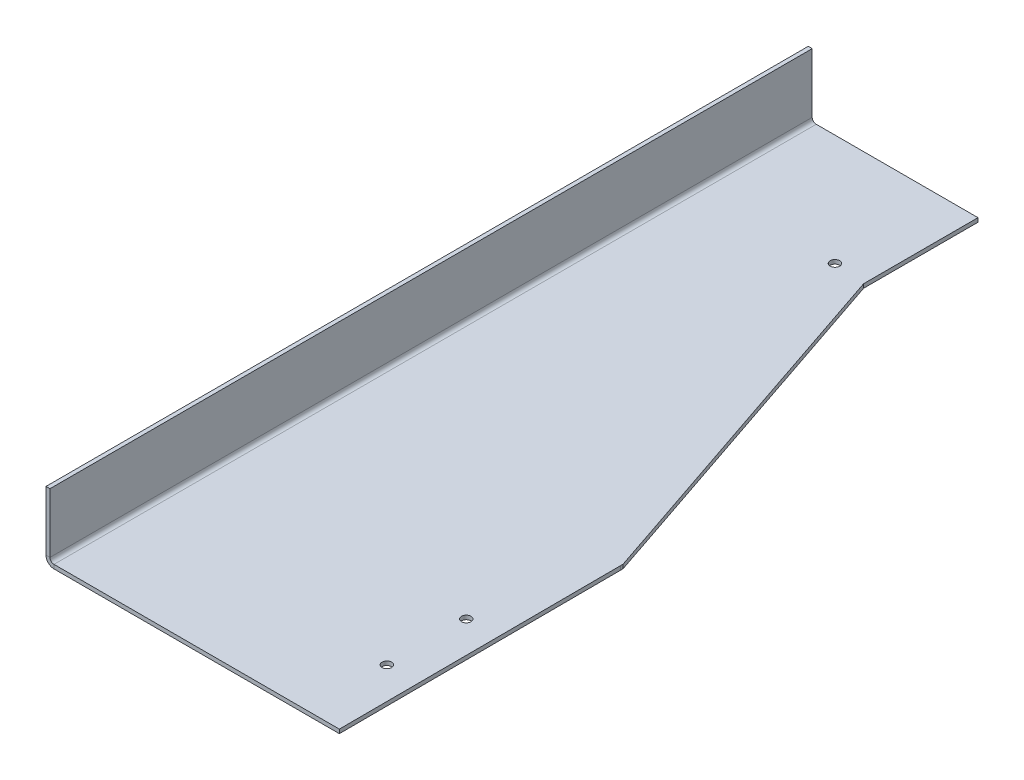
ISO-10303-21;
HEADER;
FILE_DESCRIPTION(('STEP AP214'),'2;1');
FILE_NAME('part.step','',(''),(''),'','','');
FILE_SCHEMA(('AUTOMOTIVE_DESIGN { 1 0 10303 214 1 1 1 1 }'));
ENDSEC;
DATA;
#1=APPLICATION_CONTEXT('core data for automotive mechanical design processes');
#2=APPLICATION_PROTOCOL_DEFINITION('international standard','automotive_design',2000,#1);
#3=PRODUCT_CONTEXT('',#1,'mechanical');
#4=PRODUCT('Part','Part','',(#3));
#5=PRODUCT_RELATED_PRODUCT_CATEGORY('part','',(#4));
#6=PRODUCT_DEFINITION_FORMATION('','',#4);
#7=PRODUCT_DEFINITION_CONTEXT('part definition',#1,'design');
#8=PRODUCT_DEFINITION('design','',#6,#7);
#9=PRODUCT_DEFINITION_SHAPE('','',#8);
#10=(LENGTH_UNIT() NAMED_UNIT(*) SI_UNIT(.MILLI.,.METRE.));
#11=(NAMED_UNIT(*) PLANE_ANGLE_UNIT() SI_UNIT($,.RADIAN.));
#12=(NAMED_UNIT(*) SI_UNIT($,.STERADIAN.) SOLID_ANGLE_UNIT());
#13=UNCERTAINTY_MEASURE_WITH_UNIT(LENGTH_MEASURE(1.E-05),#10,'distance_accuracy_value','');
#14=(GEOMETRIC_REPRESENTATION_CONTEXT(3) GLOBAL_UNCERTAINTY_ASSIGNED_CONTEXT((#13)) GLOBAL_UNIT_ASSIGNED_CONTEXT((#10,
#11,#12)) REPRESENTATION_CONTEXT('',''));
#15=CARTESIAN_POINT('',(0.,0.,0.));
#16=DIRECTION('',(0.,0.,1.));
#17=DIRECTION('',(1.,0.,0.));
#18=AXIS2_PLACEMENT_3D('',#15,#16,#17);
#19=CARTESIAN_POINT('',(152.4,-1.5875,0.));
#20=DIRECTION('',(0.,0.,1.));
#21=DIRECTION('',(1.,0.,0.));
#22=AXIS2_PLACEMENT_3D('',#19,#20,#21);
#23=PLANE('',#22);
#24=DIRECTION('',(1.,0.,0.));
#25=VECTOR('',#24,1.);
#26=CARTESIAN_POINT('',(152.4,-1.5875,0.));
#27=LINE('',#26,#25);
#28=CARTESIAN_POINT('',(3.18769999999999,-1.5875,0.));
#29=VERTEX_POINT('',#28);
#30=CARTESIAN_POINT('',(117.306905870663,-1.58750000000002,0.));
#31=VERTEX_POINT('',#30);
#32=EDGE_CURVE('E69',#29,#31,#27,.T.);
#33=ORIENTED_EDGE('',*,*,#32,.T.);
#34=DIRECTION('',(0.,-1.,0.));
#35=VECTOR('',#34,1.);
#36=CARTESIAN_POINT('',(117.306905870663,-1.58750000000002,0.));
#37=LINE('',#36,#35);
#38=CARTESIAN_POINT('',(117.306905870663,0.,0.));
#39=VERTEX_POINT('',#38);
#40=EDGE_CURVE('E148',#31,#39,#37,.F.);
#41=ORIENTED_EDGE('',*,*,#40,.T.);
#42=DIRECTION('',(1.,0.,0.));
#43=VECTOR('',#42,1.);
#44=CARTESIAN_POINT('',(152.4,0.,0.));
#45=LINE('',#44,#43);
#46=CARTESIAN_POINT('',(3.18769999999999,0.,0.));
#47=VERTEX_POINT('',#46);
#48=EDGE_CURVE('E161',#47,#39,#45,.T.);
#49=ORIENTED_EDGE('',*,*,#48,.F.);
#50=DIRECTION('',(0.,-1.,0.));
#51=VECTOR('',#50,1.);
#52=CARTESIAN_POINT('',(3.18769999999999,0.,0.));
#53=LINE('',#52,#51);
#54=EDGE_CURVE('E175',#47,#29,#53,.T.);
#55=ORIENTED_EDGE('',*,*,#54,.T.);
#56=EDGE_LOOP('',(#33,#41,#49,#55));
#57=FACE_BOUND('',#56,.T.);
#58=ADVANCED_FACE('F61',(#57),#23,.T.);
#59=CARTESIAN_POINT('',(0.,-1.5875,0.));
#60=DIRECTION('',(0.,-1.,0.));
#61=DIRECTION('',(0.,0.,-1.));
#62=AXIS2_PLACEMENT_3D('',#59,#60,#61);
#63=PLANE('',#62);
#64=CARTESIAN_POINT('',(55.1180000036381,-1.5875,-260.349999989162));
#65=DIRECTION('',(0.,-1.,0.));
#66=DIRECTION('',(0.,0.,-1.));
#67=AXIS2_PLACEMENT_3D('',#64,#65,#66);
#68=CIRCLE('',#67,1.89864999999999);
#69=CARTESIAN_POINT('',(55.1180000036381,-1.5875,-262.248649989162));
#70=VERTEX_POINT('',#69);
#71=EDGE_CURVE('E195',#70,#70,#68,.T.);
#72=ORIENTED_EDGE('',*,*,#71,.F.);
#73=EDGE_LOOP('',(#72));
#74=FACE_BOUND('',#73,.T.);
#75=CARTESIAN_POINT('',(104.543184668519,-1.5875,-31.7500000163771));
#76=DIRECTION('',(0.,-1.,0.));
#77=DIRECTION('',(0.,0.,-1.));
#78=AXIS2_PLACEMENT_3D('',#75,#76,#77);
#79=CIRCLE('',#78,1.89864999999999);
#80=CARTESIAN_POINT('',(104.543184668519,-1.5875,-33.648650016377));
#81=VERTEX_POINT('',#80);
#82=EDGE_CURVE('E185',#81,#81,#79,.T.);
#83=ORIENTED_EDGE('',*,*,#82,.F.);
#84=EDGE_LOOP('',(#83));
#85=FACE_BOUND('',#84,.T.);
#86=CARTESIAN_POINT('',(104.543184668519,-1.5875,-63.500000016377));
#87=DIRECTION('',(0.,-1.,0.));
#88=DIRECTION('',(0.,0.,-1.));
#89=AXIS2_PLACEMENT_3D('',#86,#87,#88);
#90=CIRCLE('',#89,1.89864999999999);
#91=CARTESIAN_POINT('',(104.543184668519,-1.5875,-65.398650016377));
#92=VERTEX_POINT('',#91);
#93=EDGE_CURVE('E182',#92,#92,#90,.T.);
#94=ORIENTED_EDGE('',*,*,#93,.F.);
#95=EDGE_LOOP('',(#94));
#96=FACE_BOUND('',#95,.T.);
#97=DIRECTION('',(-1.,0.,0.));
#98=VECTOR('',#97,1.);
#99=CARTESIAN_POINT('',(0.,-1.5875,-304.8));
#100=LINE('',#99,#98);
#101=CARTESIAN_POINT('',(67.8767662600492,-1.5875,-304.8));
#102=VERTEX_POINT('',#101);
#103=CARTESIAN_POINT('',(3.18769999999999,-1.5875,-304.8));
#104=VERTEX_POINT('',#103);
#105=EDGE_CURVE('E13',#102,#104,#100,.T.);
#106=ORIENTED_EDGE('',*,*,#105,.F.);
#107=DIRECTION('',(0.,0.,1.));
#108=VECTOR('',#107,1.);
#109=CARTESIAN_POINT('',(67.8767662600492,-1.5875,0.));
#110=LINE('',#109,#108);
#111=CARTESIAN_POINT('',(67.8767662600492,-1.58750000000002,-259.065654239976));
#112=VERTEX_POINT('',#111);
#113=EDGE_CURVE('E77',#102,#112,#110,.T.);
#114=ORIENTED_EDGE('',*,*,#113,.T.);
#115=DIRECTION('',(0.319938388047957,0.,0.947438350423538));
#116=VECTOR('',#115,1.);
#117=CARTESIAN_POINT('',(139.457334607889,-1.5875,-47.0930428517769));
#118=LINE('',#117,#116);
#119=CARTESIAN_POINT('',(116.914364330597,-1.58750000000002,-113.849879077264));
#120=VERTEX_POINT('',#119);
#121=EDGE_CURVE('E207',#112,#120,#118,.T.);
#122=ORIENTED_EDGE('',*,*,#121,.T.);
#123=DIRECTION('',(0.,0.,1.));
#124=VECTOR('',#123,1.);
#125=CARTESIAN_POINT('',(116.914364330597,-1.5875,0.));
#126=LINE('',#125,#124);
#127=CARTESIAN_POINT('',(116.914364330597,-1.58750000000002,-112.848219234024));
#128=VERTEX_POINT('',#127);
#129=EDGE_CURVE('E204',#120,#128,#126,.T.);
#130=ORIENTED_EDGE('',*,*,#129,.T.);
#131=DIRECTION('',(0.00347847017786281,0.,0.99999395010431));
#132=VECTOR('',#131,1.);
#133=CARTESIAN_POINT('',(117.305486485868,-1.5875,-0.408046105077154));
#134=LINE('',#133,#132);
#135=EDGE_CURVE('E181',#128,#31,#134,.T.);
#136=ORIENTED_EDGE('',*,*,#135,.T.);
#137=ORIENTED_EDGE('',*,*,#32,.F.);
#138=DIRECTION('',(0.,0.,1.));
#139=VECTOR('',#138,1.);
#140=CARTESIAN_POINT('',(3.18769999999999,-1.5875,0.));
#141=LINE('',#140,#139);
#142=EDGE_CURVE('E250',#29,#104,#141,.F.);
#143=ORIENTED_EDGE('',*,*,#142,.T.);
#144=EDGE_LOOP('',(#106,#114,#122,#130,#136,#137,#143));
#145=FACE_BOUND('',#144,.T.);
#146=ADVANCED_FACE('F268',(#74,#85,#96,#145),#63,.T.);
#147=CARTESIAN_POINT('',(0.,0.,0.));
#148=DIRECTION('',(0.,-1.,0.));
#149=DIRECTION('',(0.,0.,-1.));
#150=AXIS2_PLACEMENT_3D('',#147,#148,#149);
#151=PLANE('',#150);
#152=CARTESIAN_POINT('',(55.1180000036381,0.,-260.349999989162));
#153=DIRECTION('',(0.,-1.,0.));
#154=DIRECTION('',(0.,0.,-1.));
#155=AXIS2_PLACEMENT_3D('',#152,#153,#154);
#156=CIRCLE('',#155,1.89864999999999);
#157=CARTESIAN_POINT('',(55.1180000036381,0.,-262.248649989162));
#158=VERTEX_POINT('',#157);
#159=EDGE_CURVE('E64',#158,#158,#156,.T.);
#160=ORIENTED_EDGE('',*,*,#159,.T.);
#161=EDGE_LOOP('',(#160));
#162=FACE_BOUND('',#161,.T.);
#163=CARTESIAN_POINT('',(104.543184668519,0.,-31.7500000163771));
#164=DIRECTION('',(0.,-1.,0.));
#165=DIRECTION('',(0.,0.,-1.));
#166=AXIS2_PLACEMENT_3D('',#163,#164,#165);
#167=CIRCLE('',#166,1.89864999999999);
#168=CARTESIAN_POINT('',(104.543184668519,0.,-33.648650016377));
#169=VERTEX_POINT('',#168);
#170=EDGE_CURVE('E183',#169,#169,#167,.T.);
#171=ORIENTED_EDGE('',*,*,#170,.T.);
#172=EDGE_LOOP('',(#171));
#173=FACE_BOUND('',#172,.T.);
#174=CARTESIAN_POINT('',(104.543184668519,0.,-63.500000016377));
#175=DIRECTION('',(0.,-1.,0.));
#176=DIRECTION('',(0.,0.,-1.));
#177=AXIS2_PLACEMENT_3D('',#174,#175,#176);
#178=CIRCLE('',#177,1.89864999999999);
#179=CARTESIAN_POINT('',(104.543184668519,0.,-65.398650016377));
#180=VERTEX_POINT('',#179);
#181=EDGE_CURVE('E179',#180,#180,#178,.T.);
#182=ORIENTED_EDGE('',*,*,#181,.T.);
#183=EDGE_LOOP('',(#182));
#184=FACE_BOUND('',#183,.T.);
#185=DIRECTION('',(0.,0.,-1.));
#186=VECTOR('',#185,1.);
#187=CARTESIAN_POINT('',(67.8767662600492,0.,0.));
#188=LINE('',#187,#186);
#189=CARTESIAN_POINT('',(67.8767662600492,0.,-304.8));
#190=VERTEX_POINT('',#189);
#191=CARTESIAN_POINT('',(67.8767662600492,0.,-259.065654239976));
#192=VERTEX_POINT('',#191);
#193=EDGE_CURVE('E198',#190,#192,#188,.F.);
#194=ORIENTED_EDGE('',*,*,#193,.F.);
#195=DIRECTION('',(-1.,0.,0.));
#196=VECTOR('',#195,1.);
#197=CARTESIAN_POINT('',(0.,0.,-304.8));
#198=LINE('',#197,#196);
#199=CARTESIAN_POINT('',(3.18769999999999,0.,-304.8));
#200=VERTEX_POINT('',#199);
#201=EDGE_CURVE('E170',#190,#200,#198,.T.);
#202=ORIENTED_EDGE('',*,*,#201,.T.);
#203=DIRECTION('',(0.,0.,1.));
#204=VECTOR('',#203,1.);
#205=CARTESIAN_POINT('',(3.18769999999999,0.,0.));
#206=LINE('',#205,#204);
#207=EDGE_CURVE('E169',#47,#200,#206,.F.);
#208=ORIENTED_EDGE('',*,*,#207,.F.);
#209=ORIENTED_EDGE('',*,*,#48,.T.);
#210=DIRECTION('',(0.00347847017786281,0.,0.99999395010431));
#211=VECTOR('',#210,1.);
#212=CARTESIAN_POINT('',(117.305486485868,0.,-0.408046105077154));
#213=LINE('',#212,#211);
#214=CARTESIAN_POINT('',(116.914364330597,0.,-112.848219234024));
#215=VERTEX_POINT('',#214);
#216=EDGE_CURVE('E145',#215,#39,#213,.T.);
#217=ORIENTED_EDGE('',*,*,#216,.F.);
#218=DIRECTION('',(0.,0.,-1.));
#219=VECTOR('',#218,1.);
#220=CARTESIAN_POINT('',(116.914364330597,0.,0.));
#221=LINE('',#220,#219);
#222=CARTESIAN_POINT('',(116.914364330597,0.,-113.849879077264));
#223=VERTEX_POINT('',#222);
#224=EDGE_CURVE('E155',#223,#215,#221,.F.);
#225=ORIENTED_EDGE('',*,*,#224,.F.);
#226=DIRECTION('',(0.319938388047957,0.,0.947438350423538));
#227=VECTOR('',#226,1.);
#228=CARTESIAN_POINT('',(139.457334607889,0.,-47.0930428517769));
#229=LINE('',#228,#227);
#230=EDGE_CURVE('E200',#192,#223,#229,.T.);
#231=ORIENTED_EDGE('',*,*,#230,.F.);
#232=EDGE_LOOP('',(#194,#202,#208,#209,#217,#225,#231));
#233=FACE_BOUND('',#232,.T.);
#234=ADVANCED_FACE('F167',(#162,#173,#184,#233),#151,.F.);
#235=CARTESIAN_POINT('',(0.,-1.5875,-304.8));
#236=DIRECTION('',(0.,0.,-1.));
#237=DIRECTION('',(-1.,0.,0.));
#238=AXIS2_PLACEMENT_3D('',#235,#236,#237);
#239=PLANE('',#238);
#240=ORIENTED_EDGE('',*,*,#201,.F.);
#241=DIRECTION('',(0.,-1.,0.));
#242=VECTOR('',#241,1.);
#243=CARTESIAN_POINT('',(67.8767662600492,-1.5875,-304.8));
#244=LINE('',#243,#242);
#245=EDGE_CURVE('E163',#102,#190,#244,.F.);
#246=ORIENTED_EDGE('',*,*,#245,.F.);
#247=ORIENTED_EDGE('',*,*,#105,.T.);
#248=DIRECTION('',(0.,-1.,0.));
#249=VECTOR('',#248,1.);
#250=CARTESIAN_POINT('',(3.18769999999999,0.,-304.8));
#251=LINE('',#250,#249);
#252=EDGE_CURVE('E171',#200,#104,#251,.T.);
#253=ORIENTED_EDGE('',*,*,#252,.F.);
#254=EDGE_LOOP('',(#240,#246,#247,#253));
#255=FACE_BOUND('',#254,.T.);
#256=ADVANCED_FACE('F277',(#255),#239,.T.);
#257=CARTESIAN_POINT('',(3.18769999999999,1.6002,-304.8));
#258=DIRECTION('',(0.,0.,-1.));
#259=DIRECTION('',(-1.,0.,0.));
#260=AXIS2_PLACEMENT_3D('',#257,#258,#259);
#261=PLANE('',#260);
#262=DIRECTION('',(1.,0.,0.));
#263=VECTOR('',#262,1.);
#264=CARTESIAN_POINT('',(0.,1.60019999999999,-304.8));
#265=LINE('',#264,#263);
#266=CARTESIAN_POINT('',(1.58749999999999,1.60019999999999,-304.8));
#267=VERTEX_POINT('',#266);
#268=CARTESIAN_POINT('',(0.,1.60019999999999,-304.8));
#269=VERTEX_POINT('',#268);
#270=EDGE_CURVE('E218',#267,#269,#265,.F.);
#271=ORIENTED_EDGE('',*,*,#270,.F.);
#272=CARTESIAN_POINT('',(3.18769999999999,1.6002,-304.8));
#273=DIRECTION('',(0.,0.,1.));
#274=DIRECTION('',(1.,0.,0.));
#275=AXIS2_PLACEMENT_3D('',#272,#273,#274);
#276=CIRCLE('',#275,1.6002);
#277=EDGE_CURVE('E259',#200,#267,#276,.F.);
#278=ORIENTED_EDGE('',*,*,#277,.F.);
#279=ORIENTED_EDGE('',*,*,#252,.T.);
#280=CARTESIAN_POINT('',(3.18769999999999,1.6002,-304.8));
#281=DIRECTION('',(0.,0.,1.));
#282=DIRECTION('',(1.,0.,0.));
#283=AXIS2_PLACEMENT_3D('',#280,#281,#282);
#284=CIRCLE('',#283,3.1877);
#285=EDGE_CURVE('E253',#104,#269,#284,.F.);
#286=ORIENTED_EDGE('',*,*,#285,.T.);
#287=EDGE_LOOP('',(#271,#278,#279,#286));
#288=FACE_BOUND('',#287,.T.);
#289=ADVANCED_FACE('F283',(#288),#261,.T.);
#290=CARTESIAN_POINT('',(3.18769999999999,1.6002,0.));
#291=DIRECTION('',(0.,0.,-1.));
#292=DIRECTION('',(-1.,0.,0.));
#293=AXIS2_PLACEMENT_3D('',#290,#291,#292);
#294=PLANE('',#293);
#295=CARTESIAN_POINT('',(3.18769999999999,1.6002,0.));
#296=DIRECTION('',(0.,0.,1.));
#297=DIRECTION('',(1.,0.,0.));
#298=AXIS2_PLACEMENT_3D('',#295,#296,#297);
#299=CIRCLE('',#298,1.6002);
#300=CARTESIAN_POINT('',(1.58749999999999,1.60019999999999,0.));
#301=VERTEX_POINT('',#300);
#302=EDGE_CURVE('E223',#301,#47,#299,.T.);
#303=ORIENTED_EDGE('',*,*,#302,.F.);
#304=DIRECTION('',(1.,0.,0.));
#305=VECTOR('',#304,1.);
#306=CARTESIAN_POINT('',(1.58749999999999,1.60019999999999,0.));
#307=LINE('',#306,#305);
#308=CARTESIAN_POINT('',(0.,1.60019999999999,0.));
#309=VERTEX_POINT('',#308);
#310=EDGE_CURVE('E243',#301,#309,#307,.F.);
#311=ORIENTED_EDGE('',*,*,#310,.T.);
#312=CARTESIAN_POINT('',(3.18769999999999,1.6002,0.));
#313=DIRECTION('',(0.,0.,1.));
#314=DIRECTION('',(1.,0.,0.));
#315=AXIS2_PLACEMENT_3D('',#312,#313,#314);
#316=CIRCLE('',#315,3.1877);
#317=EDGE_CURVE('E254',#309,#29,#316,.T.);
#318=ORIENTED_EDGE('',*,*,#317,.T.);
#319=ORIENTED_EDGE('',*,*,#54,.F.);
#320=EDGE_LOOP('',(#303,#311,#318,#319));
#321=FACE_BOUND('',#320,.T.);
#322=ADVANCED_FACE('F302',(#321),#294,.F.);
#323=CARTESIAN_POINT('',(3.18769999999999,1.6002,0.));
#324=DIRECTION('',(0.,0.,1.));
#325=DIRECTION('',(-1.,0.,0.));
#326=AXIS2_PLACEMENT_3D('',#323,#324,#325);
#327=CYLINDRICAL_SURFACE('',#326,3.1877);
#328=ORIENTED_EDGE('',*,*,#142,.F.);
#329=ORIENTED_EDGE('',*,*,#317,.F.);
#330=DIRECTION('',(0.,0.,1.));
#331=VECTOR('',#330,1.);
#332=CARTESIAN_POINT('',(0.,1.60019999999999,-304.8));
#333=LINE('',#332,#331);
#334=EDGE_CURVE('E241',#309,#269,#333,.F.);
#335=ORIENTED_EDGE('',*,*,#334,.T.);
#336=ORIENTED_EDGE('',*,*,#285,.F.);
#337=EDGE_LOOP('',(#328,#329,#335,#336));
#338=FACE_BOUND('',#337,.T.);
#339=ADVANCED_FACE('F312',(#338),#327,.T.);
#340=CARTESIAN_POINT('',(3.18769999999999,1.6002,0.));
#341=DIRECTION('',(0.,0.,1.));
#342=DIRECTION('',(-1.,0.,0.));
#343=AXIS2_PLACEMENT_3D('',#340,#341,#342);
#344=CYLINDRICAL_SURFACE('',#343,1.6002);
#345=ORIENTED_EDGE('',*,*,#207,.T.);
#346=ORIENTED_EDGE('',*,*,#277,.T.);
#347=DIRECTION('',(0.,0.,1.));
#348=VECTOR('',#347,1.);
#349=CARTESIAN_POINT('',(1.58749999999999,1.60019999999999,-304.8));
#350=LINE('',#349,#348);
#351=EDGE_CURVE('E246',#267,#301,#350,.T.);
#352=ORIENTED_EDGE('',*,*,#351,.T.);
#353=ORIENTED_EDGE('',*,*,#302,.T.);
#354=EDGE_LOOP('',(#345,#346,#352,#353));
#355=FACE_BOUND('',#354,.T.);
#356=ADVANCED_FACE('F280',(#355),#344,.F.);
#357=CARTESIAN_POINT('',(0.,25.4,0.));
#358=DIRECTION('',(0.,0.,-1.));
#359=DIRECTION('',(-1.,0.,0.));
#360=AXIS2_PLACEMENT_3D('',#357,#358,#359);
#361=PLANE('',#360);
#362=ORIENTED_EDGE('',*,*,#310,.F.);
#363=DIRECTION('',(0.,-1.,0.));
#364=VECTOR('',#363,1.);
#365=CARTESIAN_POINT('',(1.58749999999991,25.4,0.));
#366=LINE('',#365,#364);
#367=CARTESIAN_POINT('',(1.58749999999991,25.4,0.));
#368=VERTEX_POINT('',#367);
#369=EDGE_CURVE('E239',#301,#368,#366,.F.);
#370=ORIENTED_EDGE('',*,*,#369,.T.);
#371=DIRECTION('',(1.,0.,0.));
#372=VECTOR('',#371,1.);
#373=CARTESIAN_POINT('',(0.,25.4,0.));
#374=LINE('',#373,#372);
#375=CARTESIAN_POINT('',(0.,25.4,0.));
#376=VERTEX_POINT('',#375);
#377=EDGE_CURVE('E220',#376,#368,#374,.T.);
#378=ORIENTED_EDGE('',*,*,#377,.F.);
#379=DIRECTION('',(0.,1.,0.));
#380=VECTOR('',#379,1.);
#381=CARTESIAN_POINT('',(0.,0.,0.));
#382=LINE('',#381,#380);
#383=EDGE_CURVE('E232',#309,#376,#382,.T.);
#384=ORIENTED_EDGE('',*,*,#383,.F.);
#385=EDGE_LOOP('',(#362,#370,#378,#384));
#386=FACE_BOUND('',#385,.T.);
#387=ADVANCED_FACE('F304',(#386),#361,.F.);
#388=CARTESIAN_POINT('',(0.,0.,-304.8));
#389=DIRECTION('',(0.,0.,1.));
#390=DIRECTION('',(1.,0.,0.));
#391=AXIS2_PLACEMENT_3D('',#388,#389,#390);
#392=PLANE('',#391);
#393=ORIENTED_EDGE('',*,*,#270,.T.);
#394=DIRECTION('',(0.,-1.,0.));
#395=VECTOR('',#394,1.);
#396=CARTESIAN_POINT('',(0.,0.,-304.8));
#397=LINE('',#396,#395);
#398=CARTESIAN_POINT('',(0.,25.4,-304.8));
#399=VERTEX_POINT('',#398);
#400=EDGE_CURVE('E227',#399,#269,#397,.T.);
#401=ORIENTED_EDGE('',*,*,#400,.F.);
#402=DIRECTION('',(1.,0.,0.));
#403=VECTOR('',#402,1.);
#404=CARTESIAN_POINT('',(0.,25.4,-304.8));
#405=LINE('',#404,#403);
#406=CARTESIAN_POINT('',(1.58749999999991,25.4,-304.8));
#407=VERTEX_POINT('',#406);
#408=EDGE_CURVE('E224',#399,#407,#405,.T.);
#409=ORIENTED_EDGE('',*,*,#408,.T.);
#410=DIRECTION('',(0.,1.,0.));
#411=VECTOR('',#410,1.);
#412=CARTESIAN_POINT('',(1.5875,0.,-304.8));
#413=LINE('',#412,#411);
#414=EDGE_CURVE('E234',#407,#267,#413,.F.);
#415=ORIENTED_EDGE('',*,*,#414,.T.);
#416=EDGE_LOOP('',(#393,#401,#409,#415));
#417=FACE_BOUND('',#416,.T.);
#418=ADVANCED_FACE('F286',(#417),#392,.F.);
#419=CARTESIAN_POINT('',(0.,0.,0.));
#420=DIRECTION('',(1.,0.,0.));
#421=DIRECTION('',(0.,1.,0.));
#422=AXIS2_PLACEMENT_3D('',#419,#420,#421);
#423=PLANE('',#422);
#424=ORIENTED_EDGE('',*,*,#334,.F.);
#425=ORIENTED_EDGE('',*,*,#383,.T.);
#426=DIRECTION('',(0.,0.,-1.));
#427=VECTOR('',#426,1.);
#428=CARTESIAN_POINT('',(0.,25.4,0.));
#429=LINE('',#428,#427);
#430=EDGE_CURVE('E230',#376,#399,#429,.T.);
#431=ORIENTED_EDGE('',*,*,#430,.T.);
#432=ORIENTED_EDGE('',*,*,#400,.T.);
#433=EDGE_LOOP('',(#424,#425,#431,#432));
#434=FACE_BOUND('',#433,.T.);
#435=ADVANCED_FACE('F290',(#434),#423,.F.);
#436=CARTESIAN_POINT('',(1.5875,0.,0.));
#437=DIRECTION('',(1.,0.,0.));
#438=DIRECTION('',(0.,1.,0.));
#439=AXIS2_PLACEMENT_3D('',#436,#437,#438);
#440=PLANE('',#439);
#441=ORIENTED_EDGE('',*,*,#369,.F.);
#442=ORIENTED_EDGE('',*,*,#351,.F.);
#443=ORIENTED_EDGE('',*,*,#414,.F.);
#444=DIRECTION('',(0.,0.,1.));
#445=VECTOR('',#444,1.);
#446=CARTESIAN_POINT('',(1.58749999999991,25.4,-304.8));
#447=LINE('',#446,#445);
#448=EDGE_CURVE('E237',#368,#407,#447,.F.);
#449=ORIENTED_EDGE('',*,*,#448,.F.);
#450=EDGE_LOOP('',(#441,#442,#443,#449));
#451=FACE_BOUND('',#450,.T.);
#452=ADVANCED_FACE('F300',(#451),#440,.T.);
#453=CARTESIAN_POINT('',(0.,25.4,-304.8));
#454=DIRECTION('',(0.,-1.,0.));
#455=DIRECTION('',(1.,0.,0.));
#456=AXIS2_PLACEMENT_3D('',#453,#454,#455);
#457=PLANE('',#456);
#458=ORIENTED_EDGE('',*,*,#448,.T.);
#459=ORIENTED_EDGE('',*,*,#408,.F.);
#460=ORIENTED_EDGE('',*,*,#430,.F.);
#461=ORIENTED_EDGE('',*,*,#377,.T.);
#462=EDGE_LOOP('',(#458,#459,#460,#461));
#463=FACE_BOUND('',#462,.T.);
#464=ADVANCED_FACE('F296',(#463),#457,.F.);
#465=CARTESIAN_POINT('',(139.457334607889,-1.5875,-47.0930428517769));
#466=DIRECTION('',(0.947438350423538,0.,-0.319938388047957));
#467=DIRECTION('',(0.319938388047957,0.,0.947438350423538));
#468=AXIS2_PLACEMENT_3D('',#465,#466,#467);
#469=PLANE('',#468);
#470=DIRECTION('',(0.,-1.,0.));
#471=VECTOR('',#470,1.);
#472=CARTESIAN_POINT('',(116.914364330597,-1.58750000000002,-113.849879077264));
#473=LINE('',#472,#471);
#474=EDGE_CURVE('E215',#120,#223,#473,.F.);
#475=ORIENTED_EDGE('',*,*,#474,.F.);
#476=ORIENTED_EDGE('',*,*,#121,.F.);
#477=DIRECTION('',(0.,-1.,0.));
#478=VECTOR('',#477,1.);
#479=CARTESIAN_POINT('',(67.8767662600492,-1.58750000000002,-259.065654239976));
#480=LINE('',#479,#478);
#481=EDGE_CURVE('E212',#112,#192,#480,.F.);
#482=ORIENTED_EDGE('',*,*,#481,.T.);
#483=ORIENTED_EDGE('',*,*,#230,.T.);
#484=EDGE_LOOP('',(#475,#476,#482,#483));
#485=FACE_BOUND('',#484,.T.);
#486=ADVANCED_FACE('F275',(#485),#469,.T.);
#487=CARTESIAN_POINT('',(67.8767662600492,-1.5875,0.));
#488=DIRECTION('',(1.,0.,0.));
#489=DIRECTION('',(0.,0.,1.));
#490=AXIS2_PLACEMENT_3D('',#487,#488,#489);
#491=PLANE('',#490);
#492=ORIENTED_EDGE('',*,*,#481,.F.);
#493=ORIENTED_EDGE('',*,*,#113,.F.);
#494=ORIENTED_EDGE('',*,*,#245,.T.);
#495=ORIENTED_EDGE('',*,*,#193,.T.);
#496=EDGE_LOOP('',(#492,#493,#494,#495));
#497=FACE_BOUND('',#496,.T.);
#498=ADVANCED_FACE('F276',(#497),#491,.T.);
#499=CARTESIAN_POINT('',(117.305486485868,-1.5875,-0.408046105077154));
#500=DIRECTION('',(0.99999395010431,0.,-0.00347847017786281));
#501=DIRECTION('',(0.00347847017786281,0.,0.99999395010431));
#502=AXIS2_PLACEMENT_3D('',#499,#500,#501);
#503=PLANE('',#502);
#504=ORIENTED_EDGE('',*,*,#40,.F.);
#505=ORIENTED_EDGE('',*,*,#135,.F.);
#506=DIRECTION('',(0.,-1.,0.));
#507=VECTOR('',#506,1.);
#508=CARTESIAN_POINT('',(116.914364330597,-1.58750000000002,-112.848219234024));
#509=LINE('',#508,#507);
#510=EDGE_CURVE('E151',#128,#215,#509,.F.);
#511=ORIENTED_EDGE('',*,*,#510,.T.);
#512=ORIENTED_EDGE('',*,*,#216,.T.);
#513=EDGE_LOOP('',(#504,#505,#511,#512));
#514=FACE_BOUND('',#513,.T.);
#515=ADVANCED_FACE('F147',(#514),#503,.T.);
#516=CARTESIAN_POINT('',(116.914364330597,-1.5875,0.));
#517=DIRECTION('',(1.,0.,0.));
#518=DIRECTION('',(0.,0.,1.));
#519=AXIS2_PLACEMENT_3D('',#516,#517,#518);
#520=PLANE('',#519);
#521=ORIENTED_EDGE('',*,*,#129,.F.);
#522=ORIENTED_EDGE('',*,*,#474,.T.);
#523=ORIENTED_EDGE('',*,*,#224,.T.);
#524=ORIENTED_EDGE('',*,*,#510,.F.);
#525=EDGE_LOOP('',(#521,#522,#523,#524));
#526=FACE_BOUND('',#525,.T.);
#527=ADVANCED_FACE('F270',(#526),#520,.T.);
#528=CARTESIAN_POINT('',(104.543184668519,-1.5875,-63.500000016377));
#529=DIRECTION('',(0.,-1.,0.));
#530=DIRECTION('',(0.,0.,-1.));
#531=AXIS2_PLACEMENT_3D('',#528,#529,#530);
#532=CYLINDRICAL_SURFACE('',#531,1.89864999999999);
#533=ORIENTED_EDGE('',*,*,#93,.T.);
#534=EDGE_LOOP('',(#533));
#535=FACE_BOUND('',#534,.T.);
#536=ORIENTED_EDGE('',*,*,#181,.F.);
#537=EDGE_LOOP('',(#536));
#538=FACE_BOUND('',#537,.T.);
#539=ADVANCED_FACE('F432',(#535,#538),#532,.F.);
#540=CARTESIAN_POINT('',(104.543184668519,-1.5875,-31.7500000163771));
#541=DIRECTION('',(0.,-1.,0.));
#542=DIRECTION('',(0.,0.,-1.));
#543=AXIS2_PLACEMENT_3D('',#540,#541,#542);
#544=CYLINDRICAL_SURFACE('',#543,1.89864999999999);
#545=ORIENTED_EDGE('',*,*,#82,.T.);
#546=EDGE_LOOP('',(#545));
#547=FACE_BOUND('',#546,.T.);
#548=ORIENTED_EDGE('',*,*,#170,.F.);
#549=EDGE_LOOP('',(#548));
#550=FACE_BOUND('',#549,.T.);
#551=ADVANCED_FACE('F439',(#547,#550),#544,.F.);
#552=CARTESIAN_POINT('',(55.1180000036381,-1.5875,-260.349999989162));
#553=DIRECTION('',(0.,-1.,0.));
#554=DIRECTION('',(0.,0.,-1.));
#555=AXIS2_PLACEMENT_3D('',#552,#553,#554);
#556=CYLINDRICAL_SURFACE('',#555,1.89864999999999);
#557=ORIENTED_EDGE('',*,*,#71,.T.);
#558=EDGE_LOOP('',(#557));
#559=FACE_BOUND('',#558,.T.);
#560=ORIENTED_EDGE('',*,*,#159,.F.);
#561=EDGE_LOOP('',(#560));
#562=FACE_BOUND('',#561,.T.);
#563=ADVANCED_FACE('F447',(#559,#562),#556,.F.);
#564=CLOSED_SHELL('',(#58,#146,#234,#256,#289,#322,#339,#356,#387,#418,#435,#452,#464,#486,#498,
#515,#527,#539,#551,#563));
#565=MANIFOLD_SOLID_BREP('B2',#564);
#566=ADVANCED_BREP_SHAPE_REPRESENTATION('',(#18,#565),#14);
#567=SHAPE_DEFINITION_REPRESENTATION(#9,#566);
ENDSEC;
END-ISO-10303-21;
